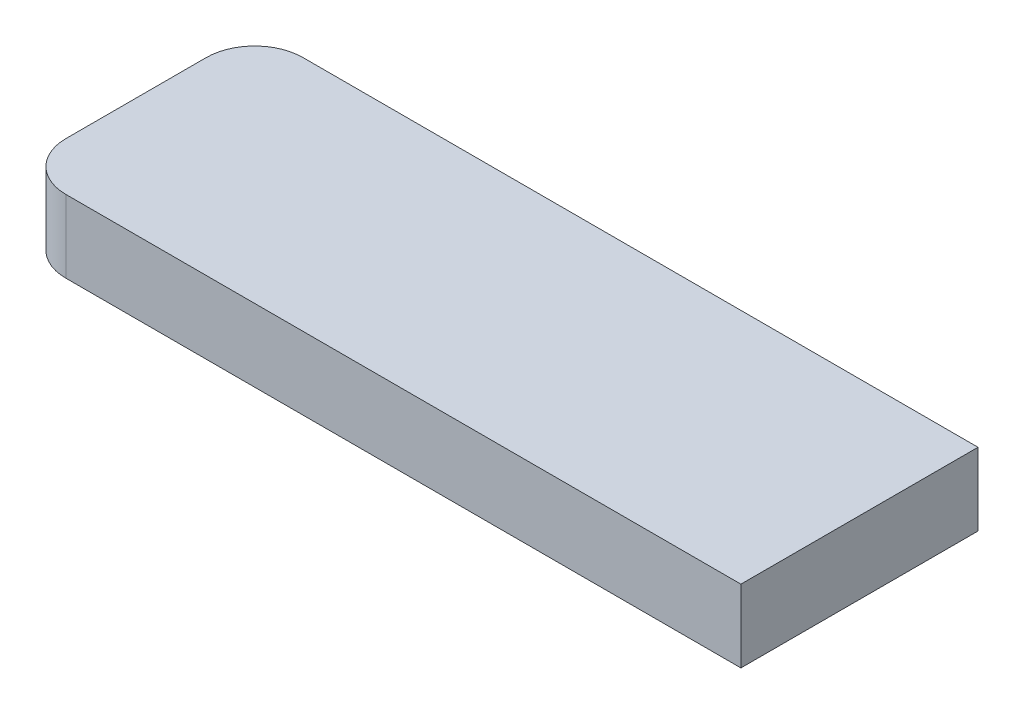
ISO-10303-21;
HEADER;
FILE_DESCRIPTION(('STEP AP214'),'2;1');
FILE_NAME('part.step','',(''),(''),'','','');
FILE_SCHEMA(('AUTOMOTIVE_DESIGN { 1 0 10303 214 1 1 1 1 }'));
ENDSEC;
DATA;
#1=APPLICATION_CONTEXT('core data for automotive mechanical design processes');
#2=APPLICATION_PROTOCOL_DEFINITION('international standard','automotive_design',2000,#1);
#3=PRODUCT_CONTEXT('',#1,'mechanical');
#4=PRODUCT('Part','Part','',(#3));
#5=PRODUCT_RELATED_PRODUCT_CATEGORY('part','',(#4));
#6=PRODUCT_DEFINITION_FORMATION('','',#4);
#7=PRODUCT_DEFINITION_CONTEXT('part definition',#1,'design');
#8=PRODUCT_DEFINITION('design','',#6,#7);
#9=PRODUCT_DEFINITION_SHAPE('','',#8);
#10=(LENGTH_UNIT() NAMED_UNIT(*) SI_UNIT(.MILLI.,.METRE.));
#11=(NAMED_UNIT(*) PLANE_ANGLE_UNIT() SI_UNIT($,.RADIAN.));
#12=(NAMED_UNIT(*) SI_UNIT($,.STERADIAN.) SOLID_ANGLE_UNIT());
#13=UNCERTAINTY_MEASURE_WITH_UNIT(LENGTH_MEASURE(1.E-05),#10,'distance_accuracy_value','');
#14=(GEOMETRIC_REPRESENTATION_CONTEXT(3) GLOBAL_UNCERTAINTY_ASSIGNED_CONTEXT((#13)) GLOBAL_UNIT_ASSIGNED_CONTEXT((#10,
#11,#12)) REPRESENTATION_CONTEXT('',''));
#15=CARTESIAN_POINT('',(0.,0.,0.));
#16=DIRECTION('',(0.,0.,1.));
#17=DIRECTION('',(1.,0.,0.));
#18=AXIS2_PLACEMENT_3D('',#15,#16,#17);
#19=CARTESIAN_POINT('',(300.,1.71683972880179E-13,0.));
#20=DIRECTION('',(-1.,0.,0.));
#21=DIRECTION('',(0.,-1.,0.));
#22=AXIS2_PLACEMENT_3D('',#19,#20,#21);
#23=PLANE('',#22);
#24=DIRECTION('',(0.,0.,-1.));
#25=VECTOR('',#24,1.);
#26=CARTESIAN_POINT('',(300.,50.,60.));
#27=LINE('',#26,#25);
#28=CARTESIAN_POINT('',(300.,50.,49.9));
#29=VERTEX_POINT('',#28);
#30=CARTESIAN_POINT('',(300.,50.,40.1));
#31=VERTEX_POINT('',#30);
#32=EDGE_CURVE('E88',#29,#31,#27,.T.);
#33=ORIENTED_EDGE('',*,*,#32,.F.);
#34=DIRECTION('',(0.,1.,0.));
#35=VECTOR('',#34,1.);
#36=CARTESIAN_POINT('',(300.,-120.,49.9));
#37=LINE('',#36,#35);
#38=CARTESIAN_POINT('',(300.,47.,49.9));
#39=VERTEX_POINT('',#38);
#40=EDGE_CURVE('E48',#39,#29,#37,.T.);
#41=ORIENTED_EDGE('',*,*,#40,.F.);
#42=DIRECTION('',(0.,0.,1.));
#43=VECTOR('',#42,1.);
#44=CARTESIAN_POINT('',(300.,47.,3.));
#45=LINE('',#44,#43);
#46=CARTESIAN_POINT('',(300.,47.,40.1));
#47=VERTEX_POINT('',#46);
#48=EDGE_CURVE('E56',#47,#39,#45,.T.);
#49=ORIENTED_EDGE('',*,*,#48,.F.);
#50=DIRECTION('',(0.,1.,0.));
#51=VECTOR('',#50,1.);
#52=CARTESIAN_POINT('',(300.,-120.,40.1));
#53=LINE('',#52,#51);
#54=EDGE_CURVE('E35',#47,#31,#53,.T.);
#55=ORIENTED_EDGE('',*,*,#54,.T.);
#56=EDGE_LOOP('',(#33,#41,#49,#55));
#57=FACE_BOUND('',#56,.T.);
#58=ADVANCED_FACE('F32',(#57),#23,.F.);
#59=CARTESIAN_POINT('',(270.1,-120.,13.1));
#60=DIRECTION('',(1.,0.,0.));
#61=DIRECTION('',(0.,0.,-1.));
#62=AXIS2_PLACEMENT_3D('',#59,#60,#61);
#63=PLANE('',#62);
#64=DIRECTION('',(0.,0.,-1.));
#65=VECTOR('',#64,1.);
#66=CARTESIAN_POINT('',(270.1,50.,13.1));
#67=LINE('',#66,#65);
#68=CARTESIAN_POINT('',(270.1,50.,47.9));
#69=VERTEX_POINT('',#68);
#70=CARTESIAN_POINT('',(270.1,50.,42.1));
#71=VERTEX_POINT('',#70);
#72=EDGE_CURVE('E11',#69,#71,#67,.T.);
#73=ORIENTED_EDGE('',*,*,#72,.T.);
#74=DIRECTION('',(0.,1.,0.));
#75=VECTOR('',#74,1.);
#76=CARTESIAN_POINT('',(270.1,-120.,42.1));
#77=LINE('',#76,#75);
#78=CARTESIAN_POINT('',(270.1,47.,42.1));
#79=VERTEX_POINT('',#78);
#80=EDGE_CURVE('E124',#71,#79,#77,.F.);
#81=ORIENTED_EDGE('',*,*,#80,.T.);
#82=DIRECTION('',(0.,0.,-1.));
#83=VECTOR('',#82,1.);
#84=CARTESIAN_POINT('',(270.1,47.,3.));
#85=LINE('',#84,#83);
#86=CARTESIAN_POINT('',(270.1,47.,47.9));
#87=VERTEX_POINT('',#86);
#88=EDGE_CURVE('E40',#87,#79,#85,.T.);
#89=ORIENTED_EDGE('',*,*,#88,.F.);
#90=DIRECTION('',(0.,1.,0.));
#91=VECTOR('',#90,1.);
#92=CARTESIAN_POINT('',(270.1,-120.,47.9));
#93=LINE('',#92,#91);
#94=EDGE_CURVE('E126',#87,#69,#93,.T.);
#95=ORIENTED_EDGE('',*,*,#94,.T.);
#96=EDGE_LOOP('',(#73,#81,#89,#95));
#97=FACE_BOUND('',#96,.T.);
#98=ADVANCED_FACE('F142',(#97),#63,.F.);
#99=CARTESIAN_POINT('',(272.1,-120.,42.1));
#100=DIRECTION('',(0.,1.,0.));
#101=DIRECTION('',(0.,0.,1.));
#102=AXIS2_PLACEMENT_3D('',#99,#100,#101);
#103=CYLINDRICAL_SURFACE('',#102,2.);
#104=CARTESIAN_POINT('',(272.1,47.,42.1));
#105=DIRECTION('',(0.,1.,0.));
#106=DIRECTION('',(0.,0.,1.));
#107=AXIS2_PLACEMENT_3D('',#104,#105,#106);
#108=CIRCLE('',#107,2.);
#109=CARTESIAN_POINT('',(272.1,47.,40.1));
#110=VERTEX_POINT('',#109);
#111=EDGE_CURVE('E120',#79,#110,#108,.F.);
#112=ORIENTED_EDGE('',*,*,#111,.F.);
#113=ORIENTED_EDGE('',*,*,#80,.F.);
#114=CARTESIAN_POINT('',(272.1,50.,42.1));
#115=DIRECTION('',(0.,-1.,0.));
#116=DIRECTION('',(0.,0.,-1.));
#117=AXIS2_PLACEMENT_3D('',#114,#115,#116);
#118=CIRCLE('',#117,2.);
#119=CARTESIAN_POINT('',(272.1,50.,40.1));
#120=VERTEX_POINT('',#119);
#121=EDGE_CURVE('E114',#120,#71,#118,.F.);
#122=ORIENTED_EDGE('',*,*,#121,.F.);
#123=DIRECTION('',(0.,1.,0.));
#124=VECTOR('',#123,1.);
#125=CARTESIAN_POINT('',(272.1,-120.,40.1));
#126=LINE('',#125,#124);
#127=EDGE_CURVE('E104',#110,#120,#126,.T.);
#128=ORIENTED_EDGE('',*,*,#127,.F.);
#129=EDGE_LOOP('',(#112,#113,#122,#128));
#130=FACE_BOUND('',#129,.T.);
#131=ADVANCED_FACE('F122',(#130),#103,.T.);
#132=CARTESIAN_POINT('',(300.,47.,3.));
#133=DIRECTION('',(0.,1.,0.));
#134=DIRECTION('',(0.,0.,1.));
#135=AXIS2_PLACEMENT_3D('',#132,#133,#134);
#136=PLANE('',#135);
#137=ORIENTED_EDGE('',*,*,#88,.T.);
#138=ORIENTED_EDGE('',*,*,#111,.T.);
#139=DIRECTION('',(1.,0.,0.));
#140=VECTOR('',#139,1.);
#141=CARTESIAN_POINT('',(300.,47.,40.1));
#142=LINE('',#141,#140);
#143=EDGE_CURVE('E99',#110,#47,#142,.T.);
#144=ORIENTED_EDGE('',*,*,#143,.T.);
#145=ORIENTED_EDGE('',*,*,#48,.T.);
#146=DIRECTION('',(-1.,0.,0.));
#147=VECTOR('',#146,1.);
#148=CARTESIAN_POINT('',(300.,47.,49.9));
#149=LINE('',#148,#147);
#150=CARTESIAN_POINT('',(272.1,47.,49.9));
#151=VERTEX_POINT('',#150);
#152=EDGE_CURVE('E105',#39,#151,#149,.T.);
#153=ORIENTED_EDGE('',*,*,#152,.T.);
#154=CARTESIAN_POINT('',(272.1,47.,47.9));
#155=DIRECTION('',(0.,1.,0.));
#156=DIRECTION('',(0.,0.,1.));
#157=AXIS2_PLACEMENT_3D('',#154,#155,#156);
#158=CIRCLE('',#157,2.);
#159=EDGE_CURVE('E131',#151,#87,#158,.F.);
#160=ORIENTED_EDGE('',*,*,#159,.T.);
#161=EDGE_LOOP('',(#137,#138,#144,#145,#153,#160));
#162=FACE_BOUND('',#161,.T.);
#163=ADVANCED_FACE('F118',(#162),#136,.F.);
#164=CARTESIAN_POINT('',(272.1,-120.,47.9));
#165=DIRECTION('',(0.,1.,0.));
#166=DIRECTION('',(0.,0.,1.));
#167=AXIS2_PLACEMENT_3D('',#164,#165,#166);
#168=CYLINDRICAL_SURFACE('',#167,2.);
#169=ORIENTED_EDGE('',*,*,#159,.F.);
#170=DIRECTION('',(0.,1.,0.));
#171=VECTOR('',#170,1.);
#172=CARTESIAN_POINT('',(272.1,-120.,49.9));
#173=LINE('',#172,#171);
#174=CARTESIAN_POINT('',(272.1,50.,49.9));
#175=VERTEX_POINT('',#174);
#176=EDGE_CURVE('E93',#175,#151,#173,.F.);
#177=ORIENTED_EDGE('',*,*,#176,.F.);
#178=CARTESIAN_POINT('',(272.1,50.,47.9));
#179=DIRECTION('',(0.,-1.,0.));
#180=DIRECTION('',(0.,0.,-1.));
#181=AXIS2_PLACEMENT_3D('',#178,#179,#180);
#182=CIRCLE('',#181,2.);
#183=EDGE_CURVE('E112',#69,#175,#182,.F.);
#184=ORIENTED_EDGE('',*,*,#183,.F.);
#185=ORIENTED_EDGE('',*,*,#94,.F.);
#186=EDGE_LOOP('',(#169,#177,#184,#185));
#187=FACE_BOUND('',#186,.T.);
#188=ADVANCED_FACE('F140',(#187),#168,.T.);
#189=CARTESIAN_POINT('',(-300.,50.,60.));
#190=DIRECTION('',(0.,-1.,0.));
#191=DIRECTION('',(0.,0.,-1.));
#192=AXIS2_PLACEMENT_3D('',#189,#190,#191);
#193=PLANE('',#192);
#194=DIRECTION('',(1.,0.,0.));
#195=VECTOR('',#194,1.);
#196=CARTESIAN_POINT('',(300.,50.,40.1));
#197=LINE('',#196,#195);
#198=EDGE_CURVE('E97',#120,#31,#197,.T.);
#199=ORIENTED_EDGE('',*,*,#198,.F.);
#200=ORIENTED_EDGE('',*,*,#121,.T.);
#201=ORIENTED_EDGE('',*,*,#72,.F.);
#202=ORIENTED_EDGE('',*,*,#183,.T.);
#203=DIRECTION('',(-1.,0.,0.));
#204=VECTOR('',#203,1.);
#205=CARTESIAN_POINT('',(270.,50.,49.9));
#206=LINE('',#205,#204);
#207=EDGE_CURVE('E98',#29,#175,#206,.T.);
#208=ORIENTED_EDGE('',*,*,#207,.F.);
#209=ORIENTED_EDGE('',*,*,#32,.T.);
#210=EDGE_LOOP('',(#199,#200,#201,#202,#208,#209));
#211=FACE_BOUND('',#210,.T.);
#212=ADVANCED_FACE('F96',(#211),#193,.F.);
#213=CARTESIAN_POINT('',(270.,-120.,49.9));
#214=DIRECTION('',(0.,0.,-1.));
#215=DIRECTION('',(-1.,0.,0.));
#216=AXIS2_PLACEMENT_3D('',#213,#214,#215);
#217=PLANE('',#216);
#218=ORIENTED_EDGE('',*,*,#207,.T.);
#219=ORIENTED_EDGE('',*,*,#176,.T.);
#220=ORIENTED_EDGE('',*,*,#152,.F.);
#221=ORIENTED_EDGE('',*,*,#40,.T.);
#222=EDGE_LOOP('',(#218,#219,#220,#221));
#223=FACE_BOUND('',#222,.T.);
#224=ADVANCED_FACE('F135',(#223),#217,.F.);
#225=CARTESIAN_POINT('',(300.,-120.,40.1));
#226=DIRECTION('',(0.,0.,1.));
#227=DIRECTION('',(1.,0.,0.));
#228=AXIS2_PLACEMENT_3D('',#225,#226,#227);
#229=PLANE('',#228);
#230=ORIENTED_EDGE('',*,*,#143,.F.);
#231=ORIENTED_EDGE('',*,*,#127,.T.);
#232=ORIENTED_EDGE('',*,*,#198,.T.);
#233=ORIENTED_EDGE('',*,*,#54,.F.);
#234=EDGE_LOOP('',(#230,#231,#232,#233));
#235=FACE_BOUND('',#234,.T.);
#236=ADVANCED_FACE('F102',(#235),#229,.F.);
#237=CLOSED_SHELL('',(#58,#98,#131,#163,#188,#212,#224,#236));
#238=MANIFOLD_SOLID_BREP('B2',#237);
#239=ADVANCED_BREP_SHAPE_REPRESENTATION('',(#18,#238),#14);
#240=SHAPE_DEFINITION_REPRESENTATION(#9,#239);
ENDSEC;
END-ISO-10303-21;
